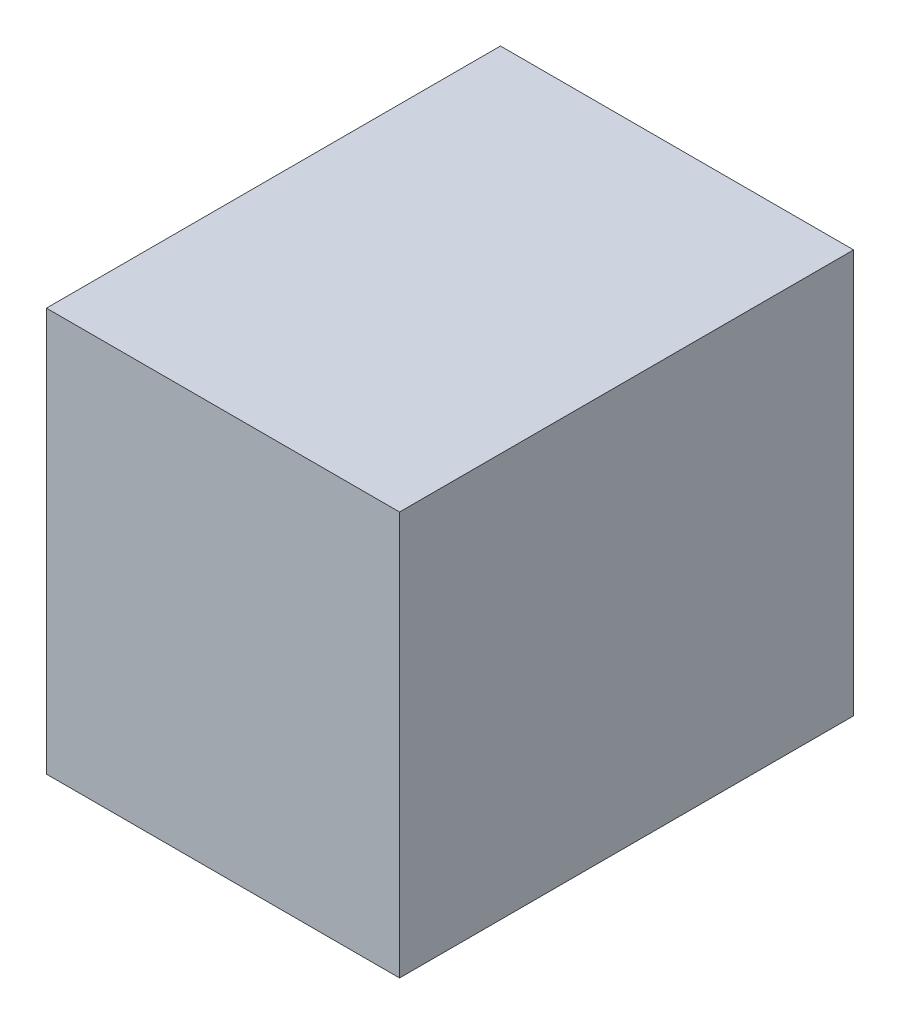
ISO-10303-21;
HEADER;
FILE_DESCRIPTION(('STEP AP214'),'2;1');
FILE_NAME('part.step','',(''),(''),'','','');
FILE_SCHEMA(('AUTOMOTIVE_DESIGN { 1 0 10303 214 1 1 1 1 }'));
ENDSEC;
DATA;
#1=APPLICATION_CONTEXT('core data for automotive mechanical design processes');
#2=APPLICATION_PROTOCOL_DEFINITION('international standard','automotive_design',2000,#1);
#3=PRODUCT_CONTEXT('',#1,'mechanical');
#4=PRODUCT('Part','Part','',(#3));
#5=PRODUCT_RELATED_PRODUCT_CATEGORY('part','',(#4));
#6=PRODUCT_DEFINITION_FORMATION('','',#4);
#7=PRODUCT_DEFINITION_CONTEXT('part definition',#1,'design');
#8=PRODUCT_DEFINITION('design','',#6,#7);
#9=PRODUCT_DEFINITION_SHAPE('','',#8);
#10=(LENGTH_UNIT() NAMED_UNIT(*) SI_UNIT(.MILLI.,.METRE.));
#11=(NAMED_UNIT(*) PLANE_ANGLE_UNIT() SI_UNIT($,.RADIAN.));
#12=(NAMED_UNIT(*) SI_UNIT($,.STERADIAN.) SOLID_ANGLE_UNIT());
#13=UNCERTAINTY_MEASURE_WITH_UNIT(LENGTH_MEASURE(1.E-05),#10,'distance_accuracy_value','');
#14=(GEOMETRIC_REPRESENTATION_CONTEXT(3) GLOBAL_UNCERTAINTY_ASSIGNED_CONTEXT((#13)) GLOBAL_UNIT_ASSIGNED_CONTEXT((#10,
#11,#12)) REPRESENTATION_CONTEXT('',''));
#15=CARTESIAN_POINT('',(0.,0.,0.));
#16=DIRECTION('',(0.,0.,1.));
#17=DIRECTION('',(1.,0.,0.));
#18=AXIS2_PLACEMENT_3D('',#15,#16,#17);
#19=CARTESIAN_POINT('',(0.,0.,45.));
#20=DIRECTION('',(1.,0.,0.));
#21=DIRECTION('',(0.,0.,-1.));
#22=AXIS2_PLACEMENT_3D('',#19,#20,#21);
#23=PLANE('',#22);
#24=DIRECTION('',(0.,-1.,0.));
#25=VECTOR('',#24,1.);
#26=CARTESIAN_POINT('',(0.,0.,0.));
#27=LINE('',#26,#25);
#28=CARTESIAN_POINT('',(0.,40.,0.));
#29=VERTEX_POINT('',#28);
#30=CARTESIAN_POINT('',(0.,0.,0.));
#31=VERTEX_POINT('',#30);
#32=EDGE_CURVE('E98',#29,#31,#27,.T.);
#33=ORIENTED_EDGE('',*,*,#32,.T.);
#34=DIRECTION('',(0.,0.,-1.));
#35=VECTOR('',#34,1.);
#36=CARTESIAN_POINT('',(0.,0.,45.));
#37=LINE('',#36,#35);
#38=CARTESIAN_POINT('',(0.,0.,45.));
#39=VERTEX_POINT('',#38);
#40=EDGE_CURVE('E11',#39,#31,#37,.T.);
#41=ORIENTED_EDGE('',*,*,#40,.F.);
#42=DIRECTION('',(0.,-1.,0.));
#43=VECTOR('',#42,1.);
#44=CARTESIAN_POINT('',(0.,0.,45.));
#45=LINE('',#44,#43);
#46=CARTESIAN_POINT('',(0.,40.,45.));
#47=VERTEX_POINT('',#46);
#48=EDGE_CURVE('E86',#47,#39,#45,.T.);
#49=ORIENTED_EDGE('',*,*,#48,.F.);
#50=DIRECTION('',(0.,0.,-1.));
#51=VECTOR('',#50,1.);
#52=CARTESIAN_POINT('',(0.,40.,45.));
#53=LINE('',#52,#51);
#54=EDGE_CURVE('E94',#47,#29,#53,.T.);
#55=ORIENTED_EDGE('',*,*,#54,.T.);
#56=EDGE_LOOP('',(#33,#41,#49,#55));
#57=FACE_BOUND('',#56,.T.);
#58=ADVANCED_FACE('F35',(#57),#23,.F.);
#59=CARTESIAN_POINT('',(0.,0.,45.));
#60=DIRECTION('',(0.,1.,0.));
#61=DIRECTION('',(-1.,0.,0.));
#62=AXIS2_PLACEMENT_3D('',#59,#60,#61);
#63=PLANE('',#62);
#64=DIRECTION('',(1.,0.,0.));
#65=VECTOR('',#64,1.);
#66=CARTESIAN_POINT('',(0.,0.,0.));
#67=LINE('',#66,#65);
#68=CARTESIAN_POINT('',(35.,0.,0.));
#69=VERTEX_POINT('',#68);
#70=EDGE_CURVE('E90',#31,#69,#67,.T.);
#71=ORIENTED_EDGE('',*,*,#70,.T.);
#72=DIRECTION('',(0.,0.,-1.));
#73=VECTOR('',#72,1.);
#74=CARTESIAN_POINT('',(35.,0.,45.));
#75=LINE('',#74,#73);
#76=CARTESIAN_POINT('',(35.,0.,45.));
#77=VERTEX_POINT('',#76);
#78=EDGE_CURVE('E43',#77,#69,#75,.T.);
#79=ORIENTED_EDGE('',*,*,#78,.F.);
#80=DIRECTION('',(1.,0.,0.));
#81=VECTOR('',#80,1.);
#82=CARTESIAN_POINT('',(0.,0.,45.));
#83=LINE('',#82,#81);
#84=EDGE_CURVE('E81',#39,#77,#83,.T.);
#85=ORIENTED_EDGE('',*,*,#84,.F.);
#86=ORIENTED_EDGE('',*,*,#40,.T.);
#87=EDGE_LOOP('',(#71,#79,#85,#86));
#88=FACE_BOUND('',#87,.T.);
#89=ADVANCED_FACE('F89',(#88),#63,.F.);
#90=CARTESIAN_POINT('',(35.,0.,45.));
#91=DIRECTION('',(-1.,0.,0.));
#92=DIRECTION('',(0.,-1.,0.));
#93=AXIS2_PLACEMENT_3D('',#90,#91,#92);
#94=PLANE('',#93);
#95=DIRECTION('',(0.,1.,0.));
#96=VECTOR('',#95,1.);
#97=CARTESIAN_POINT('',(35.,0.,0.));
#98=LINE('',#97,#96);
#99=CARTESIAN_POINT('',(35.,40.,0.));
#100=VERTEX_POINT('',#99);
#101=EDGE_CURVE('E68',#69,#100,#98,.T.);
#102=ORIENTED_EDGE('',*,*,#101,.T.);
#103=DIRECTION('',(0.,0.,-1.));
#104=VECTOR('',#103,1.);
#105=CARTESIAN_POINT('',(35.,40.,45.));
#106=LINE('',#105,#104);
#107=CARTESIAN_POINT('',(35.,40.,45.));
#108=VERTEX_POINT('',#107);
#109=EDGE_CURVE('E91',#108,#100,#106,.T.);
#110=ORIENTED_EDGE('',*,*,#109,.F.);
#111=DIRECTION('',(0.,1.,0.));
#112=VECTOR('',#111,1.);
#113=CARTESIAN_POINT('',(35.,0.,45.));
#114=LINE('',#113,#112);
#115=EDGE_CURVE('E84',#77,#108,#114,.T.);
#116=ORIENTED_EDGE('',*,*,#115,.F.);
#117=ORIENTED_EDGE('',*,*,#78,.T.);
#118=EDGE_LOOP('',(#102,#110,#116,#117));
#119=FACE_BOUND('',#118,.T.);
#120=ADVANCED_FACE('F92',(#119),#94,.F.);
#121=CARTESIAN_POINT('',(0.,40.,45.));
#122=DIRECTION('',(0.,-1.,0.));
#123=DIRECTION('',(1.,0.,0.));
#124=AXIS2_PLACEMENT_3D('',#121,#122,#123);
#125=PLANE('',#124);
#126=DIRECTION('',(-1.,0.,0.));
#127=VECTOR('',#126,1.);
#128=CARTESIAN_POINT('',(0.,40.,0.));
#129=LINE('',#128,#127);
#130=EDGE_CURVE('E74',#100,#29,#129,.T.);
#131=ORIENTED_EDGE('',*,*,#130,.T.);
#132=ORIENTED_EDGE('',*,*,#54,.F.);
#133=DIRECTION('',(-1.,0.,0.));
#134=VECTOR('',#133,1.);
#135=CARTESIAN_POINT('',(0.,40.,45.));
#136=LINE('',#135,#134);
#137=EDGE_CURVE('E51',#108,#47,#136,.T.);
#138=ORIENTED_EDGE('',*,*,#137,.F.);
#139=ORIENTED_EDGE('',*,*,#109,.T.);
#140=EDGE_LOOP('',(#131,#132,#138,#139));
#141=FACE_BOUND('',#140,.T.);
#142=ADVANCED_FACE('F105',(#141),#125,.F.);
#143=CARTESIAN_POINT('',(0.,0.,45.));
#144=DIRECTION('',(0.,0.,-1.));
#145=DIRECTION('',(-1.,0.,0.));
#146=AXIS2_PLACEMENT_3D('',#143,#144,#145);
#147=PLANE('',#146);
#148=ORIENTED_EDGE('',*,*,#48,.T.);
#149=ORIENTED_EDGE('',*,*,#84,.T.);
#150=ORIENTED_EDGE('',*,*,#115,.T.);
#151=ORIENTED_EDGE('',*,*,#137,.T.);
#152=EDGE_LOOP('',(#148,#149,#150,#151));
#153=FACE_BOUND('',#152,.T.);
#154=ADVANCED_FACE('F82',(#153),#147,.F.);
#155=CARTESIAN_POINT('',(0.,0.,0.));
#156=DIRECTION('',(0.,0.,-1.));
#157=DIRECTION('',(-1.,0.,0.));
#158=AXIS2_PLACEMENT_3D('',#155,#156,#157);
#159=PLANE('',#158);
#160=ORIENTED_EDGE('',*,*,#32,.F.);
#161=ORIENTED_EDGE('',*,*,#130,.F.);
#162=ORIENTED_EDGE('',*,*,#101,.F.);
#163=ORIENTED_EDGE('',*,*,#70,.F.);
#164=EDGE_LOOP('',(#160,#161,#162,#163));
#165=FACE_BOUND('',#164,.T.);
#166=ADVANCED_FACE('F108',(#165),#159,.T.);
#167=CLOSED_SHELL('',(#58,#89,#120,#142,#154,#166));
#168=MANIFOLD_SOLID_BREP('B2',#167);
#169=ADVANCED_BREP_SHAPE_REPRESENTATION('',(#18,#168),#14);
#170=SHAPE_DEFINITION_REPRESENTATION(#9,#169);
ENDSEC;
END-ISO-10303-21;
